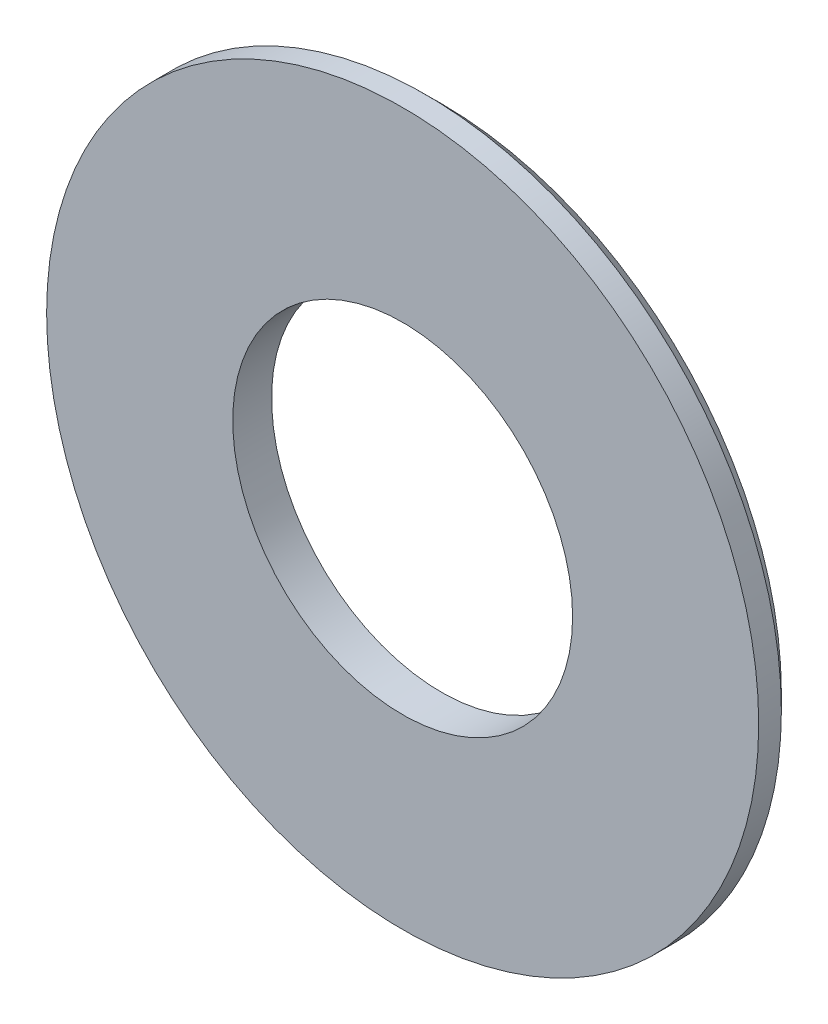
ISO-10303-21;
HEADER;
FILE_DESCRIPTION(('STEP AP214'),'2;1');
FILE_NAME('part.step','',(''),(''),'','','');
FILE_SCHEMA(('AUTOMOTIVE_DESIGN { 1 0 10303 214 1 1 1 1 }'));
ENDSEC;
DATA;
#1=APPLICATION_CONTEXT('core data for automotive mechanical design processes');
#2=APPLICATION_PROTOCOL_DEFINITION('international standard','automotive_design',2000,#1);
#3=PRODUCT_CONTEXT('',#1,'mechanical');
#4=PRODUCT('Part','Part','',(#3));
#5=PRODUCT_RELATED_PRODUCT_CATEGORY('part','',(#4));
#6=PRODUCT_DEFINITION_FORMATION('','',#4);
#7=PRODUCT_DEFINITION_CONTEXT('part definition',#1,'design');
#8=PRODUCT_DEFINITION('design','',#6,#7);
#9=PRODUCT_DEFINITION_SHAPE('','',#8);
#10=(LENGTH_UNIT() NAMED_UNIT(*) SI_UNIT(.MILLI.,.METRE.));
#11=(NAMED_UNIT(*) PLANE_ANGLE_UNIT() SI_UNIT($,.RADIAN.));
#12=(NAMED_UNIT(*) SI_UNIT($,.STERADIAN.) SOLID_ANGLE_UNIT());
#13=UNCERTAINTY_MEASURE_WITH_UNIT(LENGTH_MEASURE(1.E-05),#10,'distance_accuracy_value','');
#14=(GEOMETRIC_REPRESENTATION_CONTEXT(3) GLOBAL_UNCERTAINTY_ASSIGNED_CONTEXT((#13)) GLOBAL_UNIT_ASSIGNED_CONTEXT((#10,
#11,#12)) REPRESENTATION_CONTEXT('',''));
#15=CARTESIAN_POINT('',(0.,0.,0.));
#16=DIRECTION('',(0.,0.,1.));
#17=DIRECTION('',(1.,0.,0.));
#18=AXIS2_PLACEMENT_3D('',#15,#16,#17);
#19=CARTESIAN_POINT('',(5.25,0.,1.2));
#20=DIRECTION('',(0.,0.,1.));
#21=DIRECTION('',(1.,0.,0.));
#22=AXIS2_PLACEMENT_3D('',#19,#20,#21);
#23=PLANE('',#22);
#24=CARTESIAN_POINT('',(0.,0.,1.2));
#25=DIRECTION('',(0.,0.,1.));
#26=DIRECTION('',(1.,0.,0.));
#27=AXIS2_PLACEMENT_3D('',#24,#25,#26);
#28=CIRCLE('',#27,11.);
#29=CARTESIAN_POINT('',(11.,0.,1.2));
#30=VERTEX_POINT('',#29);
#31=EDGE_CURVE('E43',#30,#30,#28,.T.);
#32=ORIENTED_EDGE('',*,*,#31,.T.);
#33=EDGE_LOOP('',(#32));
#34=FACE_BOUND('',#33,.T.);
#35=CARTESIAN_POINT('',(0.,0.,1.2));
#36=DIRECTION('',(0.,0.,1.));
#37=DIRECTION('',(1.,0.,0.));
#38=AXIS2_PLACEMENT_3D('',#35,#36,#37);
#39=CIRCLE('',#38,5.25);
#40=CARTESIAN_POINT('',(5.25,0.,1.2));
#41=VERTEX_POINT('',#40);
#42=EDGE_CURVE('E52',#41,#41,#39,.T.);
#43=ORIENTED_EDGE('',*,*,#42,.F.);
#44=EDGE_LOOP('',(#43));
#45=FACE_BOUND('',#44,.T.);
#46=ADVANCED_FACE('F32',(#34,#45),#23,.T.);
#47=CARTESIAN_POINT('',(0.,0.,0.));
#48=DIRECTION('',(0.,0.,1.));
#49=DIRECTION('',(1.,0.,0.));
#50=AXIS2_PLACEMENT_3D('',#47,#48,#49);
#51=CYLINDRICAL_SURFACE('',#50,11.);
#52=CARTESIAN_POINT('',(0.,0.,0.499999999999997));
#53=DIRECTION('',(0.,0.,-1.));
#54=DIRECTION('',(-1.,0.,0.));
#55=AXIS2_PLACEMENT_3D('',#52,#53,#54);
#56=CIRCLE('',#55,11.);
#57=CARTESIAN_POINT('',(-11.,0.,0.499999999999998));
#58=VERTEX_POINT('',#57);
#59=EDGE_CURVE('E39',#58,#58,#56,.F.);
#60=ORIENTED_EDGE('',*,*,#59,.T.);
#61=EDGE_LOOP('',(#60));
#62=FACE_BOUND('',#61,.T.);
#63=ORIENTED_EDGE('',*,*,#31,.F.);
#64=EDGE_LOOP('',(#63));
#65=FACE_BOUND('',#64,.T.);
#66=ADVANCED_FACE('F60',(#62,#65),#51,.T.);
#67=CARTESIAN_POINT('',(11.,0.,0.));
#68=DIRECTION('',(0.,0.,-1.));
#69=DIRECTION('',(-1.,0.,0.));
#70=AXIS2_PLACEMENT_3D('',#67,#68,#69);
#71=PLANE('',#70);
#72=CARTESIAN_POINT('',(0.,0.,0.));
#73=DIRECTION('',(0.,0.,-1.));
#74=DIRECTION('',(-1.,0.,0.));
#75=AXIS2_PLACEMENT_3D('',#72,#73,#74);
#76=CIRCLE('',#75,10.5);
#77=CARTESIAN_POINT('',(-10.5,0.,0.));
#78=VERTEX_POINT('',#77);
#79=EDGE_CURVE('E10',#78,#78,#76,.T.);
#80=ORIENTED_EDGE('',*,*,#79,.T.);
#81=EDGE_LOOP('',(#80));
#82=FACE_BOUND('',#81,.T.);
#83=CARTESIAN_POINT('',(0.,0.,0.));
#84=DIRECTION('',(0.,0.,1.));
#85=DIRECTION('',(1.,0.,0.));
#86=AXIS2_PLACEMENT_3D('',#83,#84,#85);
#87=CIRCLE('',#86,5.25);
#88=CARTESIAN_POINT('',(5.25,0.,0.));
#89=VERTEX_POINT('',#88);
#90=EDGE_CURVE('E47',#89,#89,#87,.T.);
#91=ORIENTED_EDGE('',*,*,#90,.T.);
#92=EDGE_LOOP('',(#91));
#93=FACE_BOUND('',#92,.T.);
#94=ADVANCED_FACE('F65',(#82,#93),#71,.T.);
#95=CARTESIAN_POINT('',(0.,0.,0.));
#96=DIRECTION('',(0.,0.,1.));
#97=DIRECTION('',(1.,0.,0.));
#98=AXIS2_PLACEMENT_3D('',#95,#96,#97);
#99=CYLINDRICAL_SURFACE('',#98,5.25);
#100=ORIENTED_EDGE('',*,*,#42,.T.);
#101=EDGE_LOOP('',(#100));
#102=FACE_BOUND('',#101,.T.);
#103=ORIENTED_EDGE('',*,*,#90,.F.);
#104=EDGE_LOOP('',(#103));
#105=FACE_BOUND('',#104,.T.);
#106=ADVANCED_FACE('F56',(#102,#105),#99,.F.);
#107=CARTESIAN_POINT('',(0.,0.,0.499999999999997));
#108=DIRECTION('',(0.,0.,1.));
#109=DIRECTION('',(1.,0.,0.));
#110=AXIS2_PLACEMENT_3D('',#107,#108,#109);
#111=CONICAL_SURFACE('',#110,11.,0.785398163397448);
#112=ORIENTED_EDGE('',*,*,#79,.F.);
#113=EDGE_LOOP('',(#112));
#114=FACE_BOUND('',#113,.T.);
#115=ORIENTED_EDGE('',*,*,#59,.F.);
#116=EDGE_LOOP('',(#115));
#117=FACE_BOUND('',#116,.T.);
#118=ADVANCED_FACE('F34',(#114,#117),#111,.T.);
#119=CLOSED_SHELL('',(#46,#66,#94,#106,#118));
#120=MANIFOLD_SOLID_BREP('B2',#119);
#121=ADVANCED_BREP_SHAPE_REPRESENTATION('',(#18,#120),#14);
#122=SHAPE_DEFINITION_REPRESENTATION(#9,#121);
ENDSEC;
END-ISO-10303-21;
